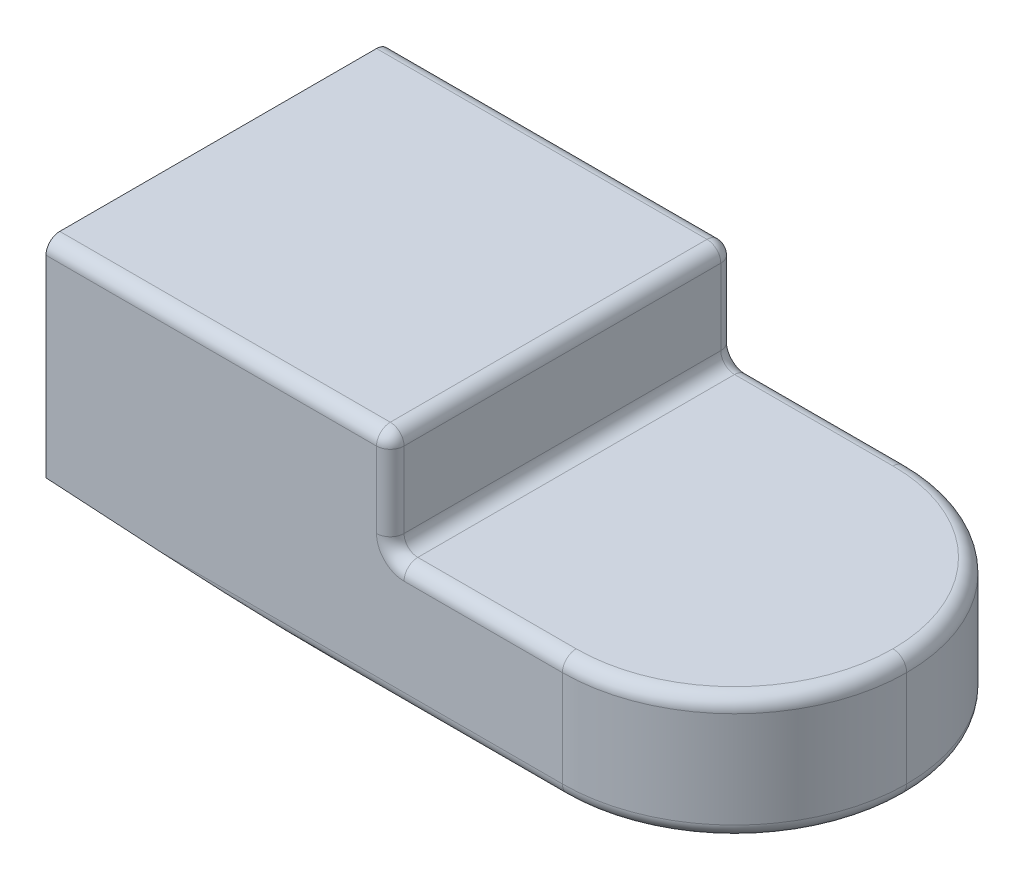
ISO-10303-21;
HEADER;
FILE_DESCRIPTION(('STEP AP214'),'2;1');
FILE_NAME('part.step','',(''),(''),'','','');
FILE_SCHEMA(('AUTOMOTIVE_DESIGN { 1 0 10303 214 1 1 1 1 }'));
ENDSEC;
DATA;
#1=APPLICATION_CONTEXT('core data for automotive mechanical design processes');
#2=APPLICATION_PROTOCOL_DEFINITION('international standard','automotive_design',2000,#1);
#3=PRODUCT_CONTEXT('',#1,'mechanical');
#4=PRODUCT('Part','Part','',(#3));
#5=PRODUCT_RELATED_PRODUCT_CATEGORY('part','',(#4));
#6=PRODUCT_DEFINITION_FORMATION('','',#4);
#7=PRODUCT_DEFINITION_CONTEXT('part definition',#1,'design');
#8=PRODUCT_DEFINITION('design','',#6,#7);
#9=PRODUCT_DEFINITION_SHAPE('','',#8);
#10=(LENGTH_UNIT() NAMED_UNIT(*) SI_UNIT(.MILLI.,.METRE.));
#11=(NAMED_UNIT(*) PLANE_ANGLE_UNIT() SI_UNIT($,.RADIAN.));
#12=(NAMED_UNIT(*) SI_UNIT($,.STERADIAN.) SOLID_ANGLE_UNIT());
#13=UNCERTAINTY_MEASURE_WITH_UNIT(LENGTH_MEASURE(1.E-05),#10,'distance_accuracy_value','');
#14=(GEOMETRIC_REPRESENTATION_CONTEXT(3) GLOBAL_UNCERTAINTY_ASSIGNED_CONTEXT((#13)) GLOBAL_UNIT_ASSIGNED_CONTEXT((#10,
#11,#12)) REPRESENTATION_CONTEXT('',''));
#15=CARTESIAN_POINT('',(0.,0.,0.));
#16=DIRECTION('',(0.,0.,1.));
#17=DIRECTION('',(1.,0.,0.));
#18=AXIS2_PLACEMENT_3D('',#15,#16,#17);
#19=CARTESIAN_POINT('',(12.5,0.,12.5));
#20=DIRECTION('',(0.,-1.,0.));
#21=DIRECTION('',(0.,0.,-1.));
#22=AXIS2_PLACEMENT_3D('',#19,#20,#21);
#23=PLANE('',#22);
#24=DIRECTION('',(-1.,0.,0.));
#25=VECTOR('',#24,1.);
#26=CARTESIAN_POINT('',(-12.5,0.,-11.5));
#27=LINE('',#26,#25);
#28=CARTESIAN_POINT('',(0.,0.,-11.5));
#29=VERTEX_POINT('',#28);
#30=CARTESIAN_POINT('',(-11.5,0.,-11.5));
#31=VERTEX_POINT('',#30);
#32=EDGE_CURVE('E296',#29,#31,#27,.T.);
#33=ORIENTED_EDGE('',*,*,#32,.T.);
#34=DIRECTION('',(0.,0.,-1.));
#35=VECTOR('',#34,1.);
#36=CARTESIAN_POINT('',(-11.5,0.,11.5));
#37=LINE('',#36,#35);
#38=CARTESIAN_POINT('',(-11.5,0.,11.5));
#39=VERTEX_POINT('',#38);
#40=EDGE_CURVE('E66',#31,#39,#37,.F.);
#41=ORIENTED_EDGE('',*,*,#40,.T.);
#42=DIRECTION('',(-1.,0.,0.));
#43=VECTOR('',#42,1.);
#44=CARTESIAN_POINT('',(12.5,0.,11.5));
#45=LINE('',#44,#43);
#46=CARTESIAN_POINT('',(0.,0.,11.5));
#47=VERTEX_POINT('',#46);
#48=EDGE_CURVE('E283',#39,#47,#45,.F.);
#49=ORIENTED_EDGE('',*,*,#48,.T.);
#50=CARTESIAN_POINT('',(0.,0.,0.));
#51=DIRECTION('',(0.,-1.,0.));
#52=DIRECTION('',(0.,0.,-1.));
#53=AXIS2_PLACEMENT_3D('',#50,#51,#52);
#54=CIRCLE('',#53,11.5);
#55=CARTESIAN_POINT('',(11.5,0.,0.));
#56=VERTEX_POINT('',#55);
#57=EDGE_CURVE('E290',#47,#56,#54,.F.);
#58=ORIENTED_EDGE('',*,*,#57,.T.);
#59=CARTESIAN_POINT('',(0.,0.,0.));
#60=DIRECTION('',(0.,-1.,0.));
#61=DIRECTION('',(0.,0.,-1.));
#62=AXIS2_PLACEMENT_3D('',#59,#60,#61);
#63=CIRCLE('',#62,11.5);
#64=EDGE_CURVE('E293',#56,#29,#63,.F.);
#65=ORIENTED_EDGE('',*,*,#64,.T.);
#66=EDGE_LOOP('',(#33,#41,#49,#58,#65));
#67=FACE_BOUND('',#66,.T.);
#68=ADVANCED_FACE('F41',(#67),#23,.F.);
#69=CARTESIAN_POINT('',(-12.5,0.,12.5));
#70=DIRECTION('',(-1.,0.,0.));
#71=DIRECTION('',(0.,0.,1.));
#72=AXIS2_PLACEMENT_3D('',#69,#70,#71);
#73=PLANE('',#72);
#74=DIRECTION('',(0.,1.,0.));
#75=VECTOR('',#74,1.);
#76=CARTESIAN_POINT('',(-12.5,6.5,-11.5));
#77=LINE('',#76,#75);
#78=CARTESIAN_POINT('',(-12.5,0.999999999999997,-11.5));
#79=VERTEX_POINT('',#78);
#80=CARTESIAN_POINT('',(-12.5,6.5,-11.5));
#81=VERTEX_POINT('',#80);
#82=EDGE_CURVE('E392',#79,#81,#77,.T.);
#83=ORIENTED_EDGE('',*,*,#82,.T.);
#84=DIRECTION('',(0.,0.,-1.));
#85=VECTOR('',#84,1.);
#86=CARTESIAN_POINT('',(-12.5,6.5,12.5));
#87=LINE('',#86,#85);
#88=CARTESIAN_POINT('',(-12.5,6.5,11.5));
#89=VERTEX_POINT('',#88);
#90=EDGE_CURVE('E399',#81,#89,#87,.F.);
#91=ORIENTED_EDGE('',*,*,#90,.T.);
#92=DIRECTION('',(0.,1.,0.));
#93=VECTOR('',#92,1.);
#94=CARTESIAN_POINT('',(-12.5,0.,11.5));
#95=LINE('',#94,#93);
#96=CARTESIAN_POINT('',(-12.5,0.999999999999997,11.5));
#97=VERTEX_POINT('',#96);
#98=EDGE_CURVE('E395',#89,#97,#95,.F.);
#99=ORIENTED_EDGE('',*,*,#98,.T.);
#100=DIRECTION('',(0.,0.,-1.));
#101=VECTOR('',#100,1.);
#102=CARTESIAN_POINT('',(-12.5,0.999999999999997,-11.5));
#103=LINE('',#102,#101);
#104=EDGE_CURVE('E389',#97,#79,#103,.T.);
#105=ORIENTED_EDGE('',*,*,#104,.T.);
#106=EDGE_LOOP('',(#83,#91,#99,#105));
#107=FACE_BOUND('',#106,.T.);
#108=ADVANCED_FACE('F525',(#107),#73,.F.);
#109=CARTESIAN_POINT('',(-12.5,7.5,12.5));
#110=DIRECTION('',(0.,-1.,0.));
#111=DIRECTION('',(1.,0.,0.));
#112=AXIS2_PLACEMENT_3D('',#109,#110,#111);
#113=PLANE('',#112);
#114=DIRECTION('',(-1.,0.,0.));
#115=VECTOR('',#114,1.);
#116=CARTESIAN_POINT('',(-12.5,7.5,11.5));
#117=LINE('',#116,#115);
#118=CARTESIAN_POINT('',(-37.5,7.49999999999999,11.5));
#119=VERTEX_POINT('',#118);
#120=CARTESIAN_POINT('',(-13.5,7.5,11.5));
#121=VERTEX_POINT('',#120);
#122=EDGE_CURVE('E340',#119,#121,#117,.F.);
#123=ORIENTED_EDGE('',*,*,#122,.T.);
#124=DIRECTION('',(0.,0.,-1.));
#125=VECTOR('',#124,1.);
#126=CARTESIAN_POINT('',(-13.5,7.5,12.5));
#127=LINE('',#126,#125);
#128=CARTESIAN_POINT('',(-13.5,7.5,-11.5));
#129=VERTEX_POINT('',#128);
#130=EDGE_CURVE('E416',#121,#129,#127,.T.);
#131=ORIENTED_EDGE('',*,*,#130,.T.);
#132=DIRECTION('',(-1.,0.,0.));
#133=VECTOR('',#132,1.);
#134=CARTESIAN_POINT('',(-37.5,7.49999999999999,-11.5));
#135=LINE('',#134,#133);
#136=CARTESIAN_POINT('',(-37.5,7.49999999999999,-11.5));
#137=VERTEX_POINT('',#136);
#138=EDGE_CURVE('E344',#129,#137,#135,.T.);
#139=ORIENTED_EDGE('',*,*,#138,.T.);
#140=DIRECTION('',(0.,0.,-1.));
#141=VECTOR('',#140,1.);
#142=CARTESIAN_POINT('',(-37.5,7.49999999999999,12.5));
#143=LINE('',#142,#141);
#144=EDGE_CURVE('E271',#119,#137,#143,.T.);
#145=ORIENTED_EDGE('',*,*,#144,.F.);
#146=EDGE_LOOP('',(#123,#131,#139,#145));
#147=FACE_BOUND('',#146,.T.);
#148=ADVANCED_FACE('F530',(#147),#113,.F.);
#149=CARTESIAN_POINT('',(-37.5,7.49999999999999,12.5));
#150=DIRECTION('',(1.,0.,0.));
#151=DIRECTION('',(0.,0.,-1.));
#152=AXIS2_PLACEMENT_3D('',#149,#150,#151);
#153=PLANE('',#152);
#154=DIRECTION('',(0.,0.,1.));
#155=VECTOR('',#154,1.);
#156=CARTESIAN_POINT('',(-37.5,-4.,4.));
#157=LINE('',#156,#155);
#158=CARTESIAN_POINT('',(-37.5,-4.,-4.));
#159=VERTEX_POINT('',#158);
#160=CARTESIAN_POINT('',(-37.5,-4.,4.));
#161=VERTEX_POINT('',#160);
#162=EDGE_CURVE('E234',#159,#161,#157,.T.);
#163=ORIENTED_EDGE('',*,*,#162,.F.);
#164=DIRECTION('',(0.,-1.,0.));
#165=VECTOR('',#164,1.);
#166=CARTESIAN_POINT('',(-37.5,-4.,-4.));
#167=LINE('',#166,#165);
#168=CARTESIAN_POINT('',(-37.5,4.,-4.));
#169=VERTEX_POINT('',#168);
#170=EDGE_CURVE('E201',#169,#159,#167,.T.);
#171=ORIENTED_EDGE('',*,*,#170,.F.);
#172=DIRECTION('',(0.,0.,-1.));
#173=VECTOR('',#172,1.);
#174=CARTESIAN_POINT('',(-37.5,4.,4.));
#175=LINE('',#174,#173);
#176=CARTESIAN_POINT('',(-37.5,4.,4.));
#177=VERTEX_POINT('',#176);
#178=EDGE_CURVE('E221',#177,#169,#175,.T.);
#179=ORIENTED_EDGE('',*,*,#178,.F.);
#180=DIRECTION('',(0.,1.,0.));
#181=VECTOR('',#180,1.);
#182=CARTESIAN_POINT('',(-37.5,-4.,4.));
#183=LINE('',#182,#181);
#184=EDGE_CURVE('E225',#161,#177,#183,.T.);
#185=ORIENTED_EDGE('',*,*,#184,.F.);
#186=EDGE_LOOP('',(#163,#171,#179,#185));
#187=FACE_BOUND('',#186,.T.);
#188=ORIENTED_EDGE('',*,*,#144,.T.);
#189=CARTESIAN_POINT('',(-37.5,6.49999999999999,-11.5));
#190=DIRECTION('',(1.,0.,0.));
#191=DIRECTION('',(0.,0.,-1.));
#192=AXIS2_PLACEMENT_3D('',#189,#190,#191);
#193=CIRCLE('',#192,1.);
#194=CARTESIAN_POINT('',(-37.5,6.49999999999999,-12.5));
#195=VERTEX_POINT('',#194);
#196=EDGE_CURVE('E350',#137,#195,#193,.F.);
#197=ORIENTED_EDGE('',*,*,#196,.T.);
#198=DIRECTION('',(0.,-1.,0.));
#199=VECTOR('',#198,1.);
#200=CARTESIAN_POINT('',(-37.5,7.49999999999999,-12.5));
#201=LINE('',#200,#199);
#202=CARTESIAN_POINT('',(-37.5,-7.50000000000001,-12.5));
#203=VERTEX_POINT('',#202);
#204=EDGE_CURVE('E244',#195,#203,#201,.T.);
#205=ORIENTED_EDGE('',*,*,#204,.T.);
#206=DIRECTION('',(0.,0.,-1.));
#207=VECTOR('',#206,1.);
#208=CARTESIAN_POINT('',(-37.5,-7.50000000000001,12.5));
#209=LINE('',#208,#207);
#210=CARTESIAN_POINT('',(-37.5,-7.50000000000001,12.5));
#211=VERTEX_POINT('',#210);
#212=EDGE_CURVE('E267',#211,#203,#209,.T.);
#213=ORIENTED_EDGE('',*,*,#212,.F.);
#214=DIRECTION('',(0.,-1.,0.));
#215=VECTOR('',#214,1.);
#216=CARTESIAN_POINT('',(-37.5,7.49999999999999,12.5));
#217=LINE('',#216,#215);
#218=CARTESIAN_POINT('',(-37.5,6.49999999999999,12.5));
#219=VERTEX_POINT('',#218);
#220=EDGE_CURVE('E250',#219,#211,#217,.T.);
#221=ORIENTED_EDGE('',*,*,#220,.F.);
#222=CARTESIAN_POINT('',(-37.5,6.49999999999999,11.5));
#223=DIRECTION('',(1.,0.,0.));
#224=DIRECTION('',(0.,0.,-1.));
#225=AXIS2_PLACEMENT_3D('',#222,#223,#224);
#226=CIRCLE('',#225,1.);
#227=EDGE_CURVE('E347',#219,#119,#226,.F.);
#228=ORIENTED_EDGE('',*,*,#227,.T.);
#229=EDGE_LOOP('',(#188,#197,#205,#213,#221,#228));
#230=FACE_BOUND('',#229,.T.);
#231=ADVANCED_FACE('F521',(#187,#230),#153,.F.);
#232=CARTESIAN_POINT('',(-12.5,-9.,12.5));
#233=DIRECTION('',(0.0598922907279466,0.998204845465779,0.));
#234=DIRECTION('',(-0.998204845465779,0.0598922907279466,0.));
#235=AXIS2_PLACEMENT_3D('',#232,#233,#234);
#236=PLANE('',#235);
#237=DIRECTION('',(0.998204845465779,-0.0598922907279466,0.));
#238=VECTOR('',#237,1.);
#239=CARTESIAN_POINT('',(-12.5,-9.,-12.5));
#240=LINE('',#239,#238);
#241=CARTESIAN_POINT('',(-29.1666666666667,-8.,-12.5));
#242=VERTEX_POINT('',#241);
#243=EDGE_CURVE('E254',#203,#242,#240,.T.);
#244=ORIENTED_EDGE('',*,*,#243,.T.);
#245=CARTESIAN_POINT('',(-29.1666666666667,-8.,-11.5));
#246=DIRECTION('',(0.0598922907279466,0.998204845465779,0.));
#247=DIRECTION('',(-0.998204845465779,0.0598922907279466,0.));
#248=AXIS2_PLACEMENT_3D('',#245,#246,#247);
#249=ELLIPSE('',#248,16.6966397151576,1.);
#250=CARTESIAN_POINT('',(-12.5,-9.,-11.5));
#251=VERTEX_POINT('',#250);
#252=EDGE_CURVE('E337',#242,#251,#249,.F.);
#253=ORIENTED_EDGE('',*,*,#252,.T.);
#254=DIRECTION('',(0.,0.,-1.));
#255=VECTOR('',#254,1.);
#256=CARTESIAN_POINT('',(-12.5,-9.,12.5));
#257=LINE('',#256,#255);
#258=CARTESIAN_POINT('',(-12.5,-9.,11.5));
#259=VERTEX_POINT('',#258);
#260=EDGE_CURVE('E258',#259,#251,#257,.T.);
#261=ORIENTED_EDGE('',*,*,#260,.F.);
#262=CARTESIAN_POINT('',(-29.1666666666667,-8.,11.5));
#263=DIRECTION('',(0.0598922907279466,0.998204845465779,0.));
#264=DIRECTION('',(0.998204845465779,-0.0598922907279466,0.));
#265=AXIS2_PLACEMENT_3D('',#262,#263,#264);
#266=ELLIPSE('',#265,16.6966397151576,1.);
#267=CARTESIAN_POINT('',(-29.1666666666667,-8.,12.5));
#268=VERTEX_POINT('',#267);
#269=EDGE_CURVE('E334',#259,#268,#266,.F.);
#270=ORIENTED_EDGE('',*,*,#269,.T.);
#271=DIRECTION('',(0.998204845465779,-0.0598922907279466,0.));
#272=VECTOR('',#271,1.);
#273=CARTESIAN_POINT('',(-12.5,-9.,12.5));
#274=LINE('',#273,#272);
#275=EDGE_CURVE('E253',#211,#268,#274,.T.);
#276=ORIENTED_EDGE('',*,*,#275,.F.);
#277=ORIENTED_EDGE('',*,*,#212,.T.);
#278=EDGE_LOOP('',(#244,#253,#261,#270,#276,#277));
#279=FACE_BOUND('',#278,.T.);
#280=ADVANCED_FACE('F511',(#279),#236,.F.);
#281=CARTESIAN_POINT('',(12.5,-9.,12.5));
#282=DIRECTION('',(0.,1.,0.));
#283=DIRECTION('',(0.,0.,1.));
#284=AXIS2_PLACEMENT_3D('',#281,#282,#283);
#285=PLANE('',#284);
#286=ORIENTED_EDGE('',*,*,#260,.T.);
#287=DIRECTION('',(1.,0.,0.));
#288=VECTOR('',#287,1.);
#289=CARTESIAN_POINT('',(0.,-9.,-11.5));
#290=LINE('',#289,#288);
#291=CARTESIAN_POINT('',(0.,-9.,-11.5));
#292=VERTEX_POINT('',#291);
#293=EDGE_CURVE('E330',#251,#292,#290,.T.);
#294=ORIENTED_EDGE('',*,*,#293,.T.);
#295=CARTESIAN_POINT('',(0.,-9.,0.));
#296=DIRECTION('',(0.,1.,0.));
#297=DIRECTION('',(0.,0.,1.));
#298=AXIS2_PLACEMENT_3D('',#295,#296,#297);
#299=CIRCLE('',#298,11.5);
#300=CARTESIAN_POINT('',(11.5,-9.,0.));
#301=VERTEX_POINT('',#300);
#302=EDGE_CURVE('E327',#292,#301,#299,.F.);
#303=ORIENTED_EDGE('',*,*,#302,.T.);
#304=CARTESIAN_POINT('',(0.,-9.,0.));
#305=DIRECTION('',(0.,1.,0.));
#306=DIRECTION('',(0.,0.,1.));
#307=AXIS2_PLACEMENT_3D('',#304,#305,#306);
#308=CIRCLE('',#307,11.5);
#309=CARTESIAN_POINT('',(0.,-9.,11.5));
#310=VERTEX_POINT('',#309);
#311=EDGE_CURVE('E324',#301,#310,#308,.F.);
#312=ORIENTED_EDGE('',*,*,#311,.T.);
#313=DIRECTION('',(1.,0.,0.));
#314=VECTOR('',#313,1.);
#315=CARTESIAN_POINT('',(12.5,-9.,11.5));
#316=LINE('',#315,#314);
#317=EDGE_CURVE('E321',#310,#259,#316,.F.);
#318=ORIENTED_EDGE('',*,*,#317,.T.);
#319=EDGE_LOOP('',(#286,#294,#303,#312,#318));
#320=FACE_BOUND('',#319,.T.);
#321=ADVANCED_FACE('F513',(#320),#285,.F.);
#322=CARTESIAN_POINT('',(0.,0.,12.5));
#323=DIRECTION('',(0.,0.,-1.));
#324=DIRECTION('',(-1.,0.,0.));
#325=AXIS2_PLACEMENT_3D('',#322,#323,#324);
#326=PLANE('',#325);
#327=DIRECTION('',(-1.,0.,0.));
#328=VECTOR('',#327,1.);
#329=CARTESIAN_POINT('',(0.,-1.,12.5));
#330=LINE('',#329,#328);
#331=CARTESIAN_POINT('',(0.,-1.,12.5));
#332=VERTEX_POINT('',#331);
#333=CARTESIAN_POINT('',(-11.5,-1.,12.5));
#334=VERTEX_POINT('',#333);
#335=EDGE_CURVE('E356',#332,#334,#330,.T.);
#336=ORIENTED_EDGE('',*,*,#335,.T.);
#337=CARTESIAN_POINT('',(-11.5,0.999999999999997,12.5));
#338=DIRECTION('',(0.,0.,-1.));
#339=DIRECTION('',(-1.,0.,0.));
#340=AXIS2_PLACEMENT_3D('',#337,#338,#339);
#341=CIRCLE('',#340,2.);
#342=CARTESIAN_POINT('',(-13.5,0.999999999999997,12.5));
#343=VERTEX_POINT('',#342);
#344=EDGE_CURVE('E11',#334,#343,#341,.T.);
#345=ORIENTED_EDGE('',*,*,#344,.T.);
#346=DIRECTION('',(0.,1.,0.));
#347=VECTOR('',#346,1.);
#348=CARTESIAN_POINT('',(-13.5,0.,12.5));
#349=LINE('',#348,#347);
#350=CARTESIAN_POINT('',(-13.5,6.5,12.5));
#351=VERTEX_POINT('',#350);
#352=EDGE_CURVE('E363',#343,#351,#349,.T.);
#353=ORIENTED_EDGE('',*,*,#352,.T.);
#354=DIRECTION('',(-1.,0.,0.));
#355=VECTOR('',#354,1.);
#356=CARTESIAN_POINT('',(0.,6.5,12.5));
#357=LINE('',#356,#355);
#358=EDGE_CURVE('E360',#351,#219,#357,.T.);
#359=ORIENTED_EDGE('',*,*,#358,.T.);
#360=ORIENTED_EDGE('',*,*,#220,.T.);
#361=ORIENTED_EDGE('',*,*,#275,.T.);
#362=DIRECTION('',(1.,0.,0.));
#363=VECTOR('',#362,1.);
#364=CARTESIAN_POINT('',(0.,-8.,12.5));
#365=LINE('',#364,#363);
#366=CARTESIAN_POINT('',(0.,-8.,12.5));
#367=VERTEX_POINT('',#366);
#368=EDGE_CURVE('E353',#268,#367,#365,.T.);
#369=ORIENTED_EDGE('',*,*,#368,.T.);
#370=DIRECTION('',(0.,1.,0.));
#371=VECTOR('',#370,1.);
#372=CARTESIAN_POINT('',(0.,0.,12.5));
#373=LINE('',#372,#371);
#374=EDGE_CURVE('E279',#367,#332,#373,.T.);
#375=ORIENTED_EDGE('',*,*,#374,.T.);
#376=EDGE_LOOP('',(#336,#345,#353,#359,#360,#361,#369,#375));
#377=FACE_BOUND('',#376,.T.);
#378=ADVANCED_FACE('F475',(#377),#326,.F.);
#379=CARTESIAN_POINT('',(0.,0.,-12.5));
#380=DIRECTION('',(0.,0.,-1.));
#381=DIRECTION('',(-1.,0.,0.));
#382=AXIS2_PLACEMENT_3D('',#379,#380,#381);
#383=PLANE('',#382);
#384=DIRECTION('',(0.,1.,0.));
#385=VECTOR('',#384,1.);
#386=CARTESIAN_POINT('',(-13.5,-1.,-12.5));
#387=LINE('',#386,#385);
#388=CARTESIAN_POINT('',(-13.5,6.5,-12.5));
#389=VERTEX_POINT('',#388);
#390=CARTESIAN_POINT('',(-13.5,0.999999999999997,-12.5));
#391=VERTEX_POINT('',#390);
#392=EDGE_CURVE('E405',#389,#391,#387,.F.);
#393=ORIENTED_EDGE('',*,*,#392,.T.);
#394=CARTESIAN_POINT('',(-11.5,0.999999999999997,-12.5));
#395=DIRECTION('',(0.,0.,-1.));
#396=DIRECTION('',(-1.,0.,0.));
#397=AXIS2_PLACEMENT_3D('',#394,#395,#396);
#398=CIRCLE('',#397,2.);
#399=CARTESIAN_POINT('',(-11.5,-1.,-12.5));
#400=VERTEX_POINT('',#399);
#401=EDGE_CURVE('E51',#391,#400,#398,.F.);
#402=ORIENTED_EDGE('',*,*,#401,.T.);
#403=DIRECTION('',(-1.,0.,0.));
#404=VECTOR('',#403,1.);
#405=CARTESIAN_POINT('',(0.,-1.,-12.5));
#406=LINE('',#405,#404);
#407=CARTESIAN_POINT('',(0.,-1.,-12.5));
#408=VERTEX_POINT('',#407);
#409=EDGE_CURVE('E306',#400,#408,#406,.F.);
#410=ORIENTED_EDGE('',*,*,#409,.T.);
#411=DIRECTION('',(0.,1.,0.));
#412=VECTOR('',#411,1.);
#413=CARTESIAN_POINT('',(0.,-9.,-12.5));
#414=LINE('',#413,#412);
#415=CARTESIAN_POINT('',(0.,-8.,-12.5));
#416=VERTEX_POINT('',#415);
#417=EDGE_CURVE('E275',#408,#416,#414,.F.);
#418=ORIENTED_EDGE('',*,*,#417,.T.);
#419=DIRECTION('',(1.,0.,0.));
#420=VECTOR('',#419,1.);
#421=CARTESIAN_POINT('',(-12.5,-8.,-12.5));
#422=LINE('',#421,#420);
#423=EDGE_CURVE('E303',#416,#242,#422,.F.);
#424=ORIENTED_EDGE('',*,*,#423,.T.);
#425=ORIENTED_EDGE('',*,*,#243,.F.);
#426=ORIENTED_EDGE('',*,*,#204,.F.);
#427=DIRECTION('',(-1.,0.,0.));
#428=VECTOR('',#427,1.);
#429=CARTESIAN_POINT('',(-12.5,6.5,-12.5));
#430=LINE('',#429,#428);
#431=EDGE_CURVE('E299',#195,#389,#430,.F.);
#432=ORIENTED_EDGE('',*,*,#431,.T.);
#433=EDGE_LOOP('',(#393,#402,#410,#418,#424,#425,#426,#432));
#434=FACE_BOUND('',#433,.T.);
#435=ADVANCED_FACE('F503',(#434),#383,.T.);
#436=CARTESIAN_POINT('',(-14.5,-4.,-4.));
#437=DIRECTION('',(0.,0.,-1.));
#438=DIRECTION('',(-1.,0.,0.));
#439=AXIS2_PLACEMENT_3D('',#436,#437,#438);
#440=PLANE('',#439);
#441=ORIENTED_EDGE('',*,*,#170,.T.);
#442=DIRECTION('',(-1.,0.,0.));
#443=VECTOR('',#442,1.);
#444=CARTESIAN_POINT('',(-14.5,-4.,-4.));
#445=LINE('',#444,#443);
#446=CARTESIAN_POINT('',(-14.5,-4.,-4.));
#447=VERTEX_POINT('',#446);
#448=EDGE_CURVE('E194',#447,#159,#445,.T.);
#449=ORIENTED_EDGE('',*,*,#448,.F.);
#450=DIRECTION('',(0.,-1.,0.));
#451=VECTOR('',#450,1.);
#452=CARTESIAN_POINT('',(-14.5,-4.,-4.));
#453=LINE('',#452,#451);
#454=CARTESIAN_POINT('',(-14.5,4.,-4.));
#455=VERTEX_POINT('',#454);
#456=EDGE_CURVE('E198',#455,#447,#453,.T.);
#457=ORIENTED_EDGE('',*,*,#456,.F.);
#458=DIRECTION('',(-1.,0.,0.));
#459=VECTOR('',#458,1.);
#460=CARTESIAN_POINT('',(-14.5,4.,-4.));
#461=LINE('',#460,#459);
#462=EDGE_CURVE('E241',#455,#169,#461,.T.);
#463=ORIENTED_EDGE('',*,*,#462,.T.);
#464=EDGE_LOOP('',(#441,#449,#457,#463));
#465=FACE_BOUND('',#464,.T.);
#466=ADVANCED_FACE('F196',(#465),#440,.F.);
#467=CARTESIAN_POINT('',(-14.5,4.,4.));
#468=DIRECTION('',(0.,1.,0.));
#469=DIRECTION('',(0.,0.,1.));
#470=AXIS2_PLACEMENT_3D('',#467,#468,#469);
#471=PLANE('',#470);
#472=ORIENTED_EDGE('',*,*,#178,.T.);
#473=ORIENTED_EDGE('',*,*,#462,.F.);
#474=DIRECTION('',(0.,0.,-1.));
#475=VECTOR('',#474,1.);
#476=CARTESIAN_POINT('',(-14.5,4.,4.));
#477=LINE('',#476,#475);
#478=CARTESIAN_POINT('',(-14.5,4.,4.));
#479=VERTEX_POINT('',#478);
#480=EDGE_CURVE('E207',#479,#455,#477,.T.);
#481=ORIENTED_EDGE('',*,*,#480,.F.);
#482=DIRECTION('',(-1.,0.,0.));
#483=VECTOR('',#482,1.);
#484=CARTESIAN_POINT('',(-14.5,4.,4.));
#485=LINE('',#484,#483);
#486=EDGE_CURVE('E245',#479,#177,#485,.T.);
#487=ORIENTED_EDGE('',*,*,#486,.T.);
#488=EDGE_LOOP('',(#472,#473,#481,#487));
#489=FACE_BOUND('',#488,.T.);
#490=ADVANCED_FACE('F661',(#489),#471,.F.);
#491=CARTESIAN_POINT('',(-14.5,-4.,4.));
#492=DIRECTION('',(0.,0.,1.));
#493=DIRECTION('',(1.,0.,0.));
#494=AXIS2_PLACEMENT_3D('',#491,#492,#493);
#495=PLANE('',#494);
#496=ORIENTED_EDGE('',*,*,#184,.T.);
#497=ORIENTED_EDGE('',*,*,#486,.F.);
#498=DIRECTION('',(0.,1.,0.));
#499=VECTOR('',#498,1.);
#500=CARTESIAN_POINT('',(-14.5,-4.,4.));
#501=LINE('',#500,#499);
#502=CARTESIAN_POINT('',(-14.5,-4.,4.));
#503=VERTEX_POINT('',#502);
#504=EDGE_CURVE('E216',#503,#479,#501,.T.);
#505=ORIENTED_EDGE('',*,*,#504,.F.);
#506=DIRECTION('',(-1.,0.,0.));
#507=VECTOR('',#506,1.);
#508=CARTESIAN_POINT('',(-14.5,-4.,4.));
#509=LINE('',#508,#507);
#510=EDGE_CURVE('E206',#503,#161,#509,.T.);
#511=ORIENTED_EDGE('',*,*,#510,.T.);
#512=EDGE_LOOP('',(#496,#497,#505,#511));
#513=FACE_BOUND('',#512,.T.);
#514=ADVANCED_FACE('F654',(#513),#495,.F.);
#515=CARTESIAN_POINT('',(-14.5,-4.,4.));
#516=DIRECTION('',(0.,-1.,0.));
#517=DIRECTION('',(0.,0.,-1.));
#518=AXIS2_PLACEMENT_3D('',#515,#516,#517);
#519=PLANE('',#518);
#520=ORIENTED_EDGE('',*,*,#162,.T.);
#521=ORIENTED_EDGE('',*,*,#510,.F.);
#522=DIRECTION('',(0.,0.,1.));
#523=VECTOR('',#522,1.);
#524=CARTESIAN_POINT('',(-14.5,-4.,4.));
#525=LINE('',#524,#523);
#526=EDGE_CURVE('E210',#447,#503,#525,.T.);
#527=ORIENTED_EDGE('',*,*,#526,.F.);
#528=ORIENTED_EDGE('',*,*,#448,.T.);
#529=EDGE_LOOP('',(#520,#521,#527,#528));
#530=FACE_BOUND('',#529,.T.);
#531=ADVANCED_FACE('F211',(#530),#519,.F.);
#532=CARTESIAN_POINT('',(-14.5,0.,0.));
#533=DIRECTION('',(-1.,0.,0.));
#534=DIRECTION('',(0.,0.,1.));
#535=AXIS2_PLACEMENT_3D('',#532,#533,#534);
#536=PLANE('',#535);
#537=ORIENTED_EDGE('',*,*,#456,.T.);
#538=ORIENTED_EDGE('',*,*,#526,.T.);
#539=ORIENTED_EDGE('',*,*,#504,.T.);
#540=ORIENTED_EDGE('',*,*,#480,.T.);
#541=EDGE_LOOP('',(#537,#538,#539,#540));
#542=FACE_BOUND('',#541,.T.);
#543=ADVANCED_FACE('F218',(#542),#536,.T.);
#544=CARTESIAN_POINT('',(0.,0.,0.));
#545=DIRECTION('',(0.,1.,0.));
#546=DIRECTION('',(-1.,0.,0.));
#547=AXIS2_PLACEMENT_3D('',#544,#545,#546);
#548=CYLINDRICAL_SURFACE('',#547,12.5);
#549=DIRECTION('',(0.,1.,0.));
#550=VECTOR('',#549,1.);
#551=CARTESIAN_POINT('',(12.5,0.,0.));
#552=LINE('',#551,#550);
#553=CARTESIAN_POINT('',(12.5,-1.,0.));
#554=VERTEX_POINT('',#553);
#555=CARTESIAN_POINT('',(12.5,-8.,0.));
#556=VERTEX_POINT('',#555);
#557=EDGE_CURVE('E235',#554,#556,#552,.F.);
#558=ORIENTED_EDGE('',*,*,#557,.F.);
#559=CARTESIAN_POINT('',(0.,-1.,0.));
#560=DIRECTION('',(0.,-1.,0.));
#561=DIRECTION('',(0.,0.,-1.));
#562=AXIS2_PLACEMENT_3D('',#559,#560,#561);
#563=CIRCLE('',#562,12.5);
#564=EDGE_CURVE('E318',#554,#332,#563,.T.);
#565=ORIENTED_EDGE('',*,*,#564,.T.);
#566=ORIENTED_EDGE('',*,*,#374,.F.);
#567=CARTESIAN_POINT('',(0.,-8.,0.));
#568=DIRECTION('',(0.,1.,0.));
#569=DIRECTION('',(0.,0.,1.));
#570=AXIS2_PLACEMENT_3D('',#567,#568,#569);
#571=CIRCLE('',#570,12.5);
#572=EDGE_CURVE('E315',#367,#556,#571,.T.);
#573=ORIENTED_EDGE('',*,*,#572,.T.);
#574=EDGE_LOOP('',(#558,#565,#566,#573));
#575=FACE_BOUND('',#574,.T.);
#576=ADVANCED_FACE('F481',(#575),#548,.T.);
#577=CARTESIAN_POINT('',(0.,0.,0.));
#578=DIRECTION('',(0.,-1.,0.));
#579=DIRECTION('',(1.,0.,0.));
#580=AXIS2_PLACEMENT_3D('',#577,#578,#579);
#581=CYLINDRICAL_SURFACE('',#580,12.5);
#582=ORIENTED_EDGE('',*,*,#417,.F.);
#583=CARTESIAN_POINT('',(0.,-1.,0.));
#584=DIRECTION('',(0.,-1.,0.));
#585=DIRECTION('',(0.,0.,-1.));
#586=AXIS2_PLACEMENT_3D('',#583,#584,#585);
#587=CIRCLE('',#586,12.5);
#588=EDGE_CURVE('E312',#408,#554,#587,.T.);
#589=ORIENTED_EDGE('',*,*,#588,.T.);
#590=ORIENTED_EDGE('',*,*,#557,.T.);
#591=CARTESIAN_POINT('',(0.,-8.,0.));
#592=DIRECTION('',(0.,1.,0.));
#593=DIRECTION('',(0.,0.,1.));
#594=AXIS2_PLACEMENT_3D('',#591,#592,#593);
#595=CIRCLE('',#594,12.5);
#596=EDGE_CURVE('E309',#556,#416,#595,.T.);
#597=ORIENTED_EDGE('',*,*,#596,.T.);
#598=EDGE_LOOP('',(#582,#589,#590,#597));
#599=FACE_BOUND('',#598,.T.);
#600=ADVANCED_FACE('F499',(#599),#581,.T.);
#601=CARTESIAN_POINT('',(0.,-1.,11.5));
#602=DIRECTION('',(-1.,0.,0.));
#603=DIRECTION('',(0.,0.,1.));
#604=AXIS2_PLACEMENT_3D('',#601,#602,#603);
#605=CYLINDRICAL_SURFACE('',#604,1.);
#606=ORIENTED_EDGE('',*,*,#48,.F.);
#607=CARTESIAN_POINT('',(-11.5,-1.,11.5));
#608=DIRECTION('',(1.,0.,0.));
#609=DIRECTION('',(0.,0.,-1.));
#610=AXIS2_PLACEMENT_3D('',#607,#608,#609);
#611=CIRCLE('',#610,1.);
#612=EDGE_CURVE('E411',#39,#334,#611,.T.);
#613=ORIENTED_EDGE('',*,*,#612,.T.);
#614=ORIENTED_EDGE('',*,*,#335,.F.);
#615=CARTESIAN_POINT('',(0.,-1.,11.5));
#616=DIRECTION('',(1.,0.,0.));
#617=DIRECTION('',(0.,0.,-1.));
#618=AXIS2_PLACEMENT_3D('',#615,#616,#617);
#619=CIRCLE('',#618,1.);
#620=EDGE_CURVE('E287',#47,#332,#619,.T.);
#621=ORIENTED_EDGE('',*,*,#620,.F.);
#622=EDGE_LOOP('',(#606,#613,#614,#621));
#623=FACE_BOUND('',#622,.T.);
#624=ADVANCED_FACE('F472',(#623),#605,.T.);
#625=CARTESIAN_POINT('',(0.,-1.,0.));
#626=DIRECTION('',(0.,-1.,0.));
#627=DIRECTION('',(0.,0.,-1.));
#628=AXIS2_PLACEMENT_3D('',#625,#626,#627);
#629=TOROIDAL_SURFACE('',#628,11.5,1.);
#630=ORIENTED_EDGE('',*,*,#620,.T.);
#631=ORIENTED_EDGE('',*,*,#564,.F.);
#632=CARTESIAN_POINT('',(11.5,-1.,0.));
#633=DIRECTION('',(0.,0.,-1.));
#634=DIRECTION('',(-1.,0.,0.));
#635=AXIS2_PLACEMENT_3D('',#632,#633,#634);
#636=CIRCLE('',#635,1.);
#637=EDGE_CURVE('E368',#56,#554,#636,.T.);
#638=ORIENTED_EDGE('',*,*,#637,.F.);
#639=ORIENTED_EDGE('',*,*,#57,.F.);
#640=EDGE_LOOP('',(#630,#631,#638,#639));
#641=FACE_BOUND('',#640,.T.);
#642=ADVANCED_FACE('F545',(#641),#629,.T.);
#643=CARTESIAN_POINT('',(0.,-1.,0.));
#644=DIRECTION('',(0.,-1.,0.));
#645=DIRECTION('',(0.,0.,-1.));
#646=AXIS2_PLACEMENT_3D('',#643,#644,#645);
#647=TOROIDAL_SURFACE('',#646,11.5,1.);
#648=ORIENTED_EDGE('',*,*,#637,.T.);
#649=ORIENTED_EDGE('',*,*,#588,.F.);
#650=CARTESIAN_POINT('',(0.,-1.,-11.5));
#651=DIRECTION('',(-1.,0.,0.));
#652=DIRECTION('',(0.,0.,1.));
#653=AXIS2_PLACEMENT_3D('',#650,#651,#652);
#654=CIRCLE('',#653,1.);
#655=EDGE_CURVE('E364',#29,#408,#654,.T.);
#656=ORIENTED_EDGE('',*,*,#655,.F.);
#657=ORIENTED_EDGE('',*,*,#64,.F.);
#658=EDGE_LOOP('',(#648,#649,#656,#657));
#659=FACE_BOUND('',#658,.T.);
#660=ADVANCED_FACE('F542',(#659),#647,.T.);
#661=CARTESIAN_POINT('',(12.5,-1.,-11.5));
#662=DIRECTION('',(1.,0.,0.));
#663=DIRECTION('',(0.,0.,-1.));
#664=AXIS2_PLACEMENT_3D('',#661,#662,#663);
#665=CYLINDRICAL_SURFACE('',#664,1.);
#666=ORIENTED_EDGE('',*,*,#409,.F.);
#667=CARTESIAN_POINT('',(-11.5,-1.,-11.5));
#668=DIRECTION('',(1.,0.,0.));
#669=DIRECTION('',(0.,0.,-1.));
#670=AXIS2_PLACEMENT_3D('',#667,#668,#669);
#671=CIRCLE('',#670,1.);
#672=EDGE_CURVE('E59',#400,#31,#671,.T.);
#673=ORIENTED_EDGE('',*,*,#672,.T.);
#674=ORIENTED_EDGE('',*,*,#32,.F.);
#675=ORIENTED_EDGE('',*,*,#655,.T.);
#676=EDGE_LOOP('',(#666,#673,#674,#675));
#677=FACE_BOUND('',#676,.T.);
#678=ADVANCED_FACE('F539',(#677),#665,.T.);
#679=CARTESIAN_POINT('',(0.,-8.,11.5));
#680=DIRECTION('',(1.,0.,0.));
#681=DIRECTION('',(0.,0.,-1.));
#682=AXIS2_PLACEMENT_3D('',#679,#680,#681);
#683=CYLINDRICAL_SURFACE('',#682,1.);
#684=ORIENTED_EDGE('',*,*,#269,.F.);
#685=ORIENTED_EDGE('',*,*,#317,.F.);
#686=CARTESIAN_POINT('',(0.,-8.,11.5));
#687=DIRECTION('',(1.,0.,0.));
#688=DIRECTION('',(0.,0.,-1.));
#689=AXIS2_PLACEMENT_3D('',#686,#687,#688);
#690=CIRCLE('',#689,1.);
#691=EDGE_CURVE('E369',#367,#310,#690,.T.);
#692=ORIENTED_EDGE('',*,*,#691,.F.);
#693=ORIENTED_EDGE('',*,*,#368,.F.);
#694=EDGE_LOOP('',(#684,#685,#692,#693));
#695=FACE_BOUND('',#694,.T.);
#696=ADVANCED_FACE('F487',(#695),#683,.T.);
#697=CARTESIAN_POINT('',(0.,-8.,0.));
#698=DIRECTION('',(0.,1.,0.));
#699=DIRECTION('',(0.,0.,1.));
#700=AXIS2_PLACEMENT_3D('',#697,#698,#699);
#701=TOROIDAL_SURFACE('',#700,11.5,1.);
#702=ORIENTED_EDGE('',*,*,#691,.T.);
#703=ORIENTED_EDGE('',*,*,#311,.F.);
#704=CARTESIAN_POINT('',(11.5,-8.,0.));
#705=DIRECTION('',(0.,0.,-1.));
#706=DIRECTION('',(-1.,0.,0.));
#707=AXIS2_PLACEMENT_3D('',#704,#705,#706);
#708=CIRCLE('',#707,1.);
#709=EDGE_CURVE('E379',#556,#301,#708,.T.);
#710=ORIENTED_EDGE('',*,*,#709,.F.);
#711=ORIENTED_EDGE('',*,*,#572,.F.);
#712=EDGE_LOOP('',(#702,#703,#710,#711));
#713=FACE_BOUND('',#712,.T.);
#714=ADVANCED_FACE('F491',(#713),#701,.T.);
#715=CARTESIAN_POINT('',(0.,-8.,0.));
#716=DIRECTION('',(0.,1.,0.));
#717=DIRECTION('',(0.,0.,1.));
#718=AXIS2_PLACEMENT_3D('',#715,#716,#717);
#719=TOROIDAL_SURFACE('',#718,11.5,1.);
#720=ORIENTED_EDGE('',*,*,#709,.T.);
#721=ORIENTED_EDGE('',*,*,#302,.F.);
#722=CARTESIAN_POINT('',(0.,-8.,-11.5));
#723=DIRECTION('',(-1.,0.,0.));
#724=DIRECTION('',(0.,0.,1.));
#725=AXIS2_PLACEMENT_3D('',#722,#723,#724);
#726=CIRCLE('',#725,1.);
#727=EDGE_CURVE('E376',#416,#292,#726,.T.);
#728=ORIENTED_EDGE('',*,*,#727,.F.);
#729=ORIENTED_EDGE('',*,*,#596,.F.);
#730=EDGE_LOOP('',(#720,#721,#728,#729));
#731=FACE_BOUND('',#730,.T.);
#732=ADVANCED_FACE('F496',(#731),#719,.T.);
#733=CARTESIAN_POINT('',(12.5,-8.,-11.5));
#734=DIRECTION('',(-1.,0.,0.));
#735=DIRECTION('',(0.,0.,1.));
#736=AXIS2_PLACEMENT_3D('',#733,#734,#735);
#737=CYLINDRICAL_SURFACE('',#736,1.);
#738=ORIENTED_EDGE('',*,*,#252,.F.);
#739=ORIENTED_EDGE('',*,*,#423,.F.);
#740=ORIENTED_EDGE('',*,*,#727,.T.);
#741=ORIENTED_EDGE('',*,*,#293,.F.);
#742=EDGE_LOOP('',(#738,#739,#740,#741));
#743=FACE_BOUND('',#742,.T.);
#744=ADVANCED_FACE('F507',(#743),#737,.T.);
#745=CARTESIAN_POINT('',(-12.5,6.5,-11.5));
#746=DIRECTION('',(1.,0.,0.));
#747=DIRECTION('',(0.,1.,0.));
#748=AXIS2_PLACEMENT_3D('',#745,#746,#747);
#749=CYLINDRICAL_SURFACE('',#748,1.);
#750=ORIENTED_EDGE('',*,*,#138,.F.);
#751=CARTESIAN_POINT('',(-13.5,6.5,-11.5));
#752=DIRECTION('',(1.,0.,0.));
#753=DIRECTION('',(0.,1.,0.));
#754=AXIS2_PLACEMENT_3D('',#751,#752,#753);
#755=CIRCLE('',#754,1.);
#756=EDGE_CURVE('E408',#129,#389,#755,.F.);
#757=ORIENTED_EDGE('',*,*,#756,.T.);
#758=ORIENTED_EDGE('',*,*,#431,.F.);
#759=ORIENTED_EDGE('',*,*,#196,.F.);
#760=EDGE_LOOP('',(#750,#757,#758,#759));
#761=FACE_BOUND('',#760,.T.);
#762=ADVANCED_FACE('F554',(#761),#749,.T.);
#763=CARTESIAN_POINT('',(0.,6.5,11.5));
#764=DIRECTION('',(-1.,0.,0.));
#765=DIRECTION('',(0.,-1.,0.));
#766=AXIS2_PLACEMENT_3D('',#763,#764,#765);
#767=CYLINDRICAL_SURFACE('',#766,1.);
#768=ORIENTED_EDGE('',*,*,#358,.F.);
#769=CARTESIAN_POINT('',(-13.5,6.5,11.5));
#770=DIRECTION('',(-1.,0.,0.));
#771=DIRECTION('',(0.,-1.,0.));
#772=AXIS2_PLACEMENT_3D('',#769,#770,#771);
#773=CIRCLE('',#772,1.);
#774=EDGE_CURVE('E402',#351,#121,#773,.T.);
#775=ORIENTED_EDGE('',*,*,#774,.T.);
#776=ORIENTED_EDGE('',*,*,#122,.F.);
#777=ORIENTED_EDGE('',*,*,#227,.F.);
#778=EDGE_LOOP('',(#768,#775,#776,#777));
#779=FACE_BOUND('',#778,.T.);
#780=ADVANCED_FACE('F563',(#779),#767,.T.);
#781=CARTESIAN_POINT('',(-13.5,0.,-11.5));
#782=DIRECTION('',(0.,-1.,0.));
#783=DIRECTION('',(0.,0.,-1.));
#784=AXIS2_PLACEMENT_3D('',#781,#782,#783);
#785=CYLINDRICAL_SURFACE('',#784,1.);
#786=CARTESIAN_POINT('',(-13.5,0.999999999999997,-11.5));
#787=DIRECTION('',(0.,-1.,0.));
#788=DIRECTION('',(0.,0.,-1.));
#789=AXIS2_PLACEMENT_3D('',#786,#787,#788);
#790=CIRCLE('',#789,1.);
#791=EDGE_CURVE('E45',#391,#79,#790,.T.);
#792=ORIENTED_EDGE('',*,*,#791,.F.);
#793=ORIENTED_EDGE('',*,*,#392,.F.);
#794=CARTESIAN_POINT('',(-13.5,6.5,-11.5));
#795=DIRECTION('',(0.,1.,0.));
#796=DIRECTION('',(0.,0.,1.));
#797=AXIS2_PLACEMENT_3D('',#794,#795,#796);
#798=CIRCLE('',#797,1.);
#799=EDGE_CURVE('E444',#81,#389,#798,.T.);
#800=ORIENTED_EDGE('',*,*,#799,.F.);
#801=ORIENTED_EDGE('',*,*,#82,.F.);
#802=EDGE_LOOP('',(#792,#793,#800,#801));
#803=FACE_BOUND('',#802,.T.);
#804=ADVANCED_FACE('F43',(#803),#785,.T.);
#805=CARTESIAN_POINT('',(-11.5,0.999999999999997,-11.5));
#806=DIRECTION('',(0.,0.,-1.));
#807=DIRECTION('',(-1.,0.,0.));
#808=AXIS2_PLACEMENT_3D('',#805,#806,#807);
#809=TOROIDAL_SURFACE('',#808,2.,1.);
#810=ORIENTED_EDGE('',*,*,#401,.F.);
#811=ORIENTED_EDGE('',*,*,#791,.T.);
#812=CARTESIAN_POINT('',(-11.5,0.999999999999997,-11.5));
#813=DIRECTION('',(0.,0.,-1.));
#814=DIRECTION('',(-1.,0.,0.));
#815=AXIS2_PLACEMENT_3D('',#812,#813,#814);
#816=CIRCLE('',#815,1.);
#817=EDGE_CURVE('E441',#31,#79,#816,.T.);
#818=ORIENTED_EDGE('',*,*,#817,.F.);
#819=ORIENTED_EDGE('',*,*,#672,.F.);
#820=EDGE_LOOP('',(#810,#811,#818,#819));
#821=FACE_BOUND('',#820,.T.);
#822=ADVANCED_FACE('F457',(#821),#809,.T.);
#823=CARTESIAN_POINT('',(-13.5,6.5,-11.5));
#824=DIRECTION('',(-1.,0.,0.));
#825=DIRECTION('',(0.,0.,1.));
#826=AXIS2_PLACEMENT_3D('',#823,#824,#825);
#827=SPHERICAL_SURFACE('',#826,1.);
#828=ORIENTED_EDGE('',*,*,#799,.T.);
#829=ORIENTED_EDGE('',*,*,#756,.F.);
#830=CARTESIAN_POINT('',(-13.5,6.5,-11.5));
#831=DIRECTION('',(0.,0.,1.));
#832=DIRECTION('',(1.,0.,0.));
#833=AXIS2_PLACEMENT_3D('',#830,#831,#832);
#834=CIRCLE('',#833,1.);
#835=EDGE_CURVE('E437',#81,#129,#834,.T.);
#836=ORIENTED_EDGE('',*,*,#835,.F.);
#837=EDGE_LOOP('',(#828,#829,#836));
#838=FACE_BOUND('',#837,.T.);
#839=ADVANCED_FACE('F584',(#838),#827,.T.);
#840=CARTESIAN_POINT('',(-11.5,0.999999999999997,12.5));
#841=DIRECTION('',(0.,0.,1.));
#842=DIRECTION('',(1.,0.,0.));
#843=AXIS2_PLACEMENT_3D('',#840,#841,#842);
#844=CYLINDRICAL_SURFACE('',#843,1.);
#845=ORIENTED_EDGE('',*,*,#817,.T.);
#846=ORIENTED_EDGE('',*,*,#104,.F.);
#847=CARTESIAN_POINT('',(-11.5,0.999999999999997,11.5));
#848=DIRECTION('',(0.,0.,-1.));
#849=DIRECTION('',(-1.,0.,0.));
#850=AXIS2_PLACEMENT_3D('',#847,#848,#849);
#851=CIRCLE('',#850,1.);
#852=EDGE_CURVE('E433',#39,#97,#851,.T.);
#853=ORIENTED_EDGE('',*,*,#852,.F.);
#854=ORIENTED_EDGE('',*,*,#40,.F.);
#855=EDGE_LOOP('',(#845,#846,#853,#854));
#856=FACE_BOUND('',#855,.T.);
#857=ADVANCED_FACE('F463',(#856),#844,.F.);
#858=CARTESIAN_POINT('',(-13.5,6.5,12.5));
#859=DIRECTION('',(0.,0.,-1.));
#860=DIRECTION('',(-1.,0.,0.));
#861=AXIS2_PLACEMENT_3D('',#858,#859,#860);
#862=CYLINDRICAL_SURFACE('',#861,1.);
#863=ORIENTED_EDGE('',*,*,#835,.T.);
#864=ORIENTED_EDGE('',*,*,#130,.F.);
#865=CARTESIAN_POINT('',(-13.5,6.5,11.5));
#866=DIRECTION('',(0.,0.,1.));
#867=DIRECTION('',(1.,0.,0.));
#868=AXIS2_PLACEMENT_3D('',#865,#866,#867);
#869=CIRCLE('',#868,1.);
#870=EDGE_CURVE('E429',#89,#121,#869,.T.);
#871=ORIENTED_EDGE('',*,*,#870,.F.);
#872=ORIENTED_EDGE('',*,*,#90,.F.);
#873=EDGE_LOOP('',(#863,#864,#871,#872));
#874=FACE_BOUND('',#873,.T.);
#875=ADVANCED_FACE('F578',(#874),#862,.T.);
#876=CARTESIAN_POINT('',(-11.5,0.999999999999997,11.5));
#877=DIRECTION('',(0.,0.,-1.));
#878=DIRECTION('',(-1.,0.,0.));
#879=AXIS2_PLACEMENT_3D('',#876,#877,#878);
#880=TOROIDAL_SURFACE('',#879,2.,1.);
#881=ORIENTED_EDGE('',*,*,#612,.F.);
#882=ORIENTED_EDGE('',*,*,#852,.T.);
#883=CARTESIAN_POINT('',(-13.5,0.999999999999997,11.5));
#884=DIRECTION('',(0.,-1.,0.));
#885=DIRECTION('',(0.,0.,-1.));
#886=AXIS2_PLACEMENT_3D('',#883,#884,#885);
#887=CIRCLE('',#886,1.);
#888=EDGE_CURVE('E426',#343,#97,#887,.F.);
#889=ORIENTED_EDGE('',*,*,#888,.F.);
#890=ORIENTED_EDGE('',*,*,#344,.F.);
#891=EDGE_LOOP('',(#881,#882,#889,#890));
#892=FACE_BOUND('',#891,.T.);
#893=ADVANCED_FACE('F469',(#892),#880,.T.);
#894=CARTESIAN_POINT('',(-13.5,6.5,11.5));
#895=DIRECTION('',(-1.,0.,0.));
#896=DIRECTION('',(0.,0.,1.));
#897=AXIS2_PLACEMENT_3D('',#894,#895,#896);
#898=SPHERICAL_SURFACE('',#897,1.);
#899=ORIENTED_EDGE('',*,*,#870,.T.);
#900=ORIENTED_EDGE('',*,*,#774,.F.);
#901=CARTESIAN_POINT('',(-13.5,6.5,11.5));
#902=DIRECTION('',(0.,-1.,0.));
#903=DIRECTION('',(0.,0.,-1.));
#904=AXIS2_PLACEMENT_3D('',#901,#902,#903);
#905=CIRCLE('',#904,1.);
#906=EDGE_CURVE('E423',#89,#351,#905,.T.);
#907=ORIENTED_EDGE('',*,*,#906,.F.);
#908=EDGE_LOOP('',(#899,#900,#907));
#909=FACE_BOUND('',#908,.T.);
#910=ADVANCED_FACE('F571',(#909),#898,.T.);
#911=CARTESIAN_POINT('',(-13.5,0.,11.5));
#912=DIRECTION('',(0.,1.,0.));
#913=DIRECTION('',(0.,0.,1.));
#914=AXIS2_PLACEMENT_3D('',#911,#912,#913);
#915=CYLINDRICAL_SURFACE('',#914,1.);
#916=ORIENTED_EDGE('',*,*,#888,.T.);
#917=ORIENTED_EDGE('',*,*,#98,.F.);
#918=ORIENTED_EDGE('',*,*,#906,.T.);
#919=ORIENTED_EDGE('',*,*,#352,.F.);
#920=EDGE_LOOP('',(#916,#917,#918,#919));
#921=FACE_BOUND('',#920,.T.);
#922=ADVANCED_FACE('F568',(#921),#915,.T.);
#923=CLOSED_SHELL('',(#68,#108,#148,#231,#280,#321,#378,#435,#466,#490,#514,#531,#543,#576,#600,
#624,#642,#660,#678,#696,#714,#732,#744,#762,#780,#804,#822,#839,#857,#875,#893,#910,#922));
#924=MANIFOLD_SOLID_BREP('B2',#923);
#925=ADVANCED_BREP_SHAPE_REPRESENTATION('',(#18,#924),#14);
#926=SHAPE_DEFINITION_REPRESENTATION(#9,#925);
ENDSEC;
END-ISO-10303-21;
